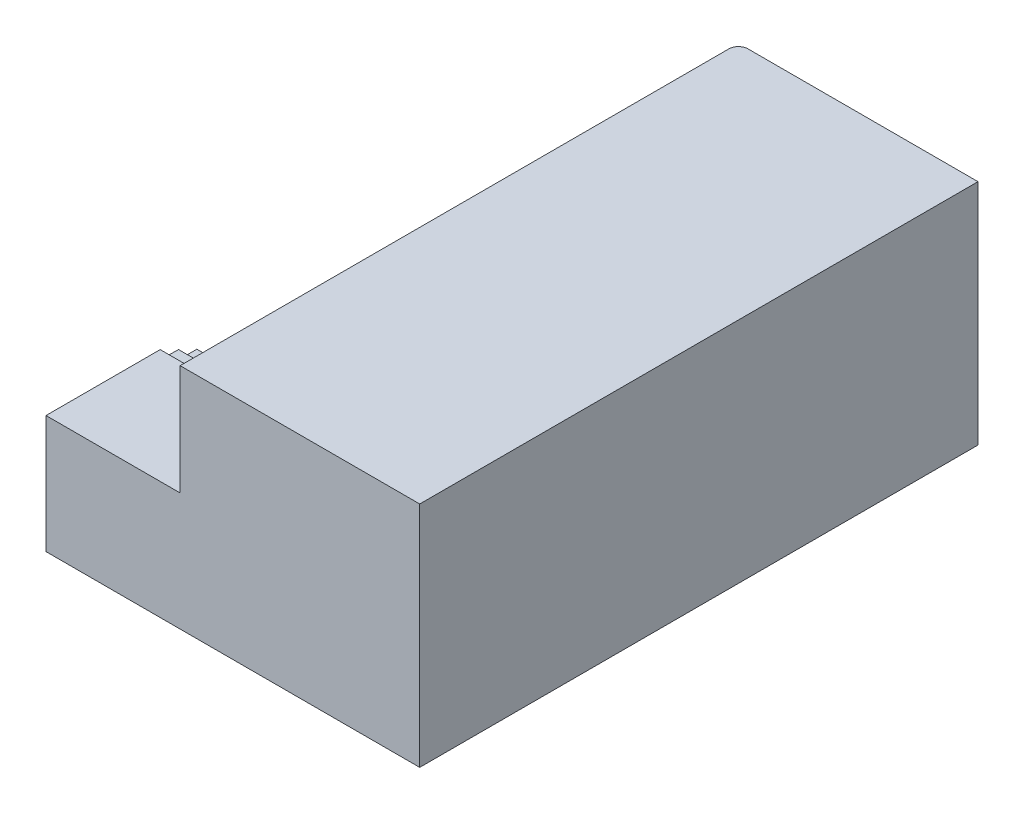
ISO-10303-21;
HEADER;
FILE_DESCRIPTION(('STEP AP214'),'2;1');
FILE_NAME('part.step','',(''),(''),'','','');
FILE_SCHEMA(('AUTOMOTIVE_DESIGN { 1 0 10303 214 1 1 1 1 }'));
ENDSEC;
DATA;
#1=APPLICATION_CONTEXT('core data for automotive mechanical design processes');
#2=APPLICATION_PROTOCOL_DEFINITION('international standard','automotive_design',2000,#1);
#3=PRODUCT_CONTEXT('',#1,'mechanical');
#4=PRODUCT('Part','Part','',(#3));
#5=PRODUCT_RELATED_PRODUCT_CATEGORY('part','',(#4));
#6=PRODUCT_DEFINITION_FORMATION('','',#4);
#7=PRODUCT_DEFINITION_CONTEXT('part definition',#1,'design');
#8=PRODUCT_DEFINITION('design','',#6,#7);
#9=PRODUCT_DEFINITION_SHAPE('','',#8);
#10=(LENGTH_UNIT() NAMED_UNIT(*) SI_UNIT(.MILLI.,.METRE.));
#11=(NAMED_UNIT(*) PLANE_ANGLE_UNIT() SI_UNIT($,.RADIAN.));
#12=(NAMED_UNIT(*) SI_UNIT($,.STERADIAN.) SOLID_ANGLE_UNIT());
#13=UNCERTAINTY_MEASURE_WITH_UNIT(LENGTH_MEASURE(1.E-05),#10,'distance_accuracy_value','');
#14=(GEOMETRIC_REPRESENTATION_CONTEXT(3) GLOBAL_UNCERTAINTY_ASSIGNED_CONTEXT((#13)) GLOBAL_UNIT_ASSIGNED_CONTEXT((#10,
#11,#12)) REPRESENTATION_CONTEXT('',''));
#15=CARTESIAN_POINT('',(0.,0.,0.));
#16=DIRECTION('',(0.,0.,1.));
#17=DIRECTION('',(1.,0.,0.));
#18=AXIS2_PLACEMENT_3D('',#15,#16,#17);
#19=CARTESIAN_POINT('',(-280.,73.7131457703675,60.));
#20=DIRECTION('',(0.,0.,-1.));
#21=DIRECTION('',(-1.,0.,0.));
#22=AXIS2_PLACEMENT_3D('',#19,#20,#21);
#23=PLANE('',#22);
#24=DIRECTION('',(0.,1.,0.));
#25=VECTOR('',#24,1.);
#26=CARTESIAN_POINT('',(0.,73.7131457703675,60.));
#27=LINE('',#26,#25);
#28=CARTESIAN_POINT('',(0.,55.2131457703675,60.));
#29=VERTEX_POINT('',#28);
#30=CARTESIAN_POINT('',(0.,73.7131457703675,60.));
#31=VERTEX_POINT('',#30);
#32=EDGE_CURVE('E328',#29,#31,#27,.T.);
#33=ORIENTED_EDGE('',*,*,#32,.F.);
#34=DIRECTION('',(1.,0.,0.));
#35=VECTOR('',#34,1.);
#36=CARTESIAN_POINT('',(-280.,55.2131457703675,60.));
#37=LINE('',#36,#35);
#38=CARTESIAN_POINT('',(-280.,55.2131457703675,60.));
#39=VERTEX_POINT('',#38);
#40=EDGE_CURVE('E535',#39,#29,#37,.T.);
#41=ORIENTED_EDGE('',*,*,#40,.F.);
#42=DIRECTION('',(0.,1.,0.));
#43=VECTOR('',#42,1.);
#44=CARTESIAN_POINT('',(-280.,73.7131457703675,60.));
#45=LINE('',#44,#43);
#46=CARTESIAN_POINT('',(-280.,73.7131457703675,60.));
#47=VERTEX_POINT('',#46);
#48=EDGE_CURVE('E329',#39,#47,#45,.T.);
#49=ORIENTED_EDGE('',*,*,#48,.T.);
#50=DIRECTION('',(1.,0.,0.));
#51=VECTOR('',#50,1.);
#52=CARTESIAN_POINT('',(-280.,73.7131457703675,60.));
#53=LINE('',#52,#51);
#54=EDGE_CURVE('E432',#47,#31,#53,.T.);
#55=ORIENTED_EDGE('',*,*,#54,.T.);
#56=EDGE_LOOP('',(#33,#41,#49,#55));
#57=FACE_BOUND('',#56,.T.);
#58=ADVANCED_FACE('F39',(#57),#23,.T.);
#59=CARTESIAN_POINT('',(-280.,55.2131457703675,60.));
#60=DIRECTION('',(0.,0.99989905724305,-0.0142082836563894));
#61=DIRECTION('',(0.,0.0142082836563894,0.99989905724305));
#62=AXIS2_PLACEMENT_3D('',#59,#60,#61);
#63=PLANE('',#62);
#64=DIRECTION('',(0.,0.0142082836563894,0.99989905724305));
#65=VECTOR('',#64,1.);
#66=CARTESIAN_POINT('',(0.,55.2131457703675,60.));
#67=LINE('',#66,#65);
#68=CARTESIAN_POINT('',(0.,54.6689685063278,21.7038661075912));
#69=VERTEX_POINT('',#68);
#70=EDGE_CURVE('E334',#69,#29,#67,.T.);
#71=ORIENTED_EDGE('',*,*,#70,.F.);
#72=DIRECTION('',(1.,0.,0.));
#73=VECTOR('',#72,1.);
#74=CARTESIAN_POINT('',(-280.,54.6689685063278,21.7038661075912));
#75=LINE('',#74,#73);
#76=CARTESIAN_POINT('',(-280.,54.6689685063278,21.7038661075912));
#77=VERTEX_POINT('',#76);
#78=EDGE_CURVE('E540',#77,#69,#75,.T.);
#79=ORIENTED_EDGE('',*,*,#78,.F.);
#80=DIRECTION('',(0.,0.0142082836563894,0.99989905724305));
#81=VECTOR('',#80,1.);
#82=CARTESIAN_POINT('',(-280.,55.2131457703675,60.));
#83=LINE('',#82,#81);
#84=EDGE_CURVE('E428',#77,#39,#83,.T.);
#85=ORIENTED_EDGE('',*,*,#84,.T.);
#86=ORIENTED_EDGE('',*,*,#40,.T.);
#87=EDGE_LOOP('',(#71,#79,#85,#86));
#88=FACE_BOUND('',#87,.T.);
#89=ADVANCED_FACE('F645',(#88),#63,.T.);
#90=CARTESIAN_POINT('',(-280.,54.6689685063278,21.7038661075912));
#91=DIRECTION('',(0.,0.,-1.));
#92=DIRECTION('',(0.,1.,0.));
#93=AXIS2_PLACEMENT_3D('',#90,#91,#92);
#94=PLANE('',#93);
#95=DIRECTION('',(0.,1.,0.));
#96=VECTOR('',#95,1.);
#97=CARTESIAN_POINT('',(0.,54.6689685063278,21.7038661075912));
#98=LINE('',#97,#96);
#99=CARTESIAN_POINT('',(0.,36.1689685063278,21.7038661075912));
#100=VERTEX_POINT('',#99);
#101=EDGE_CURVE('E528',#100,#69,#98,.T.);
#102=ORIENTED_EDGE('',*,*,#101,.F.);
#103=DIRECTION('',(1.,0.,0.));
#104=VECTOR('',#103,1.);
#105=CARTESIAN_POINT('',(-280.,36.1689685063278,21.7038661075912));
#106=LINE('',#105,#104);
#107=CARTESIAN_POINT('',(-280.,36.1689685063278,21.7038661075912));
#108=VERTEX_POINT('',#107);
#109=EDGE_CURVE('E543',#108,#100,#106,.T.);
#110=ORIENTED_EDGE('',*,*,#109,.F.);
#111=DIRECTION('',(0.,1.,0.));
#112=VECTOR('',#111,1.);
#113=CARTESIAN_POINT('',(-280.,54.6689685063278,21.7038661075912));
#114=LINE('',#113,#112);
#115=EDGE_CURVE('E424',#108,#77,#114,.T.);
#116=ORIENTED_EDGE('',*,*,#115,.T.);
#117=ORIENTED_EDGE('',*,*,#78,.T.);
#118=EDGE_LOOP('',(#102,#110,#116,#117));
#119=FACE_BOUND('',#118,.T.);
#120=ADVANCED_FACE('F650',(#119),#94,.T.);
#121=CARTESIAN_POINT('',(-280.,36.1689685063278,21.7038661075912));
#122=DIRECTION('',(0.,1.,0.));
#123=DIRECTION('',(0.,0.,1.));
#124=AXIS2_PLACEMENT_3D('',#121,#122,#123);
#125=PLANE('',#124);
#126=DIRECTION('',(0.,0.,1.));
#127=VECTOR('',#126,1.);
#128=CARTESIAN_POINT('',(0.,36.1689685063278,21.7038661075912));
#129=LINE('',#128,#127);
#130=CARTESIAN_POINT('',(0.,36.1689685063278,-16.5961338924088));
#131=VERTEX_POINT('',#130);
#132=EDGE_CURVE('E524',#131,#100,#129,.T.);
#133=ORIENTED_EDGE('',*,*,#132,.F.);
#134=DIRECTION('',(1.,0.,0.));
#135=VECTOR('',#134,1.);
#136=CARTESIAN_POINT('',(-280.,36.1689685063278,-16.5961338924088));
#137=LINE('',#136,#135);
#138=CARTESIAN_POINT('',(-280.,36.1689685063278,-16.5961338924088));
#139=VERTEX_POINT('',#138);
#140=EDGE_CURVE('E546',#139,#131,#137,.T.);
#141=ORIENTED_EDGE('',*,*,#140,.F.);
#142=DIRECTION('',(0.,0.,1.));
#143=VECTOR('',#142,1.);
#144=CARTESIAN_POINT('',(-280.,36.1689685063278,21.7038661075912));
#145=LINE('',#144,#143);
#146=EDGE_CURVE('E420',#139,#108,#145,.T.);
#147=ORIENTED_EDGE('',*,*,#146,.T.);
#148=ORIENTED_EDGE('',*,*,#109,.T.);
#149=EDGE_LOOP('',(#133,#141,#147,#148));
#150=FACE_BOUND('',#149,.T.);
#151=ADVANCED_FACE('F739',(#150),#125,.T.);
#152=CARTESIAN_POINT('',(-280.,36.1689685063278,-16.5961338924088));
#153=DIRECTION('',(0.,0.,-1.));
#154=DIRECTION('',(0.,1.,0.));
#155=AXIS2_PLACEMENT_3D('',#152,#153,#154);
#156=PLANE('',#155);
#157=DIRECTION('',(0.,1.,0.));
#158=VECTOR('',#157,1.);
#159=CARTESIAN_POINT('',(0.,36.1689685063278,-16.5961338924088));
#160=LINE('',#159,#158);
#161=CARTESIAN_POINT('',(0.,17.6689685063278,-16.5961338924088));
#162=VERTEX_POINT('',#161);
#163=EDGE_CURVE('E520',#162,#131,#160,.T.);
#164=ORIENTED_EDGE('',*,*,#163,.F.);
#165=DIRECTION('',(1.,0.,0.));
#166=VECTOR('',#165,1.);
#167=CARTESIAN_POINT('',(-280.,17.6689685063278,-16.5961338924088));
#168=LINE('',#167,#166);
#169=CARTESIAN_POINT('',(-280.,17.6689685063278,-16.5961338924088));
#170=VERTEX_POINT('',#169);
#171=EDGE_CURVE('E549',#170,#162,#168,.T.);
#172=ORIENTED_EDGE('',*,*,#171,.F.);
#173=DIRECTION('',(0.,1.,0.));
#174=VECTOR('',#173,1.);
#175=CARTESIAN_POINT('',(-280.,36.1689685063278,-16.5961338924088));
#176=LINE('',#175,#174);
#177=EDGE_CURVE('E416',#170,#139,#176,.T.);
#178=ORIENTED_EDGE('',*,*,#177,.T.);
#179=ORIENTED_EDGE('',*,*,#140,.T.);
#180=EDGE_LOOP('',(#164,#172,#178,#179));
#181=FACE_BOUND('',#180,.T.);
#182=ADVANCED_FACE('F735',(#181),#156,.T.);
#183=CARTESIAN_POINT('',(-280.,17.6689685063278,-16.5961338924088));
#184=DIRECTION('',(0.,1.,0.));
#185=DIRECTION('',(0.,0.,1.));
#186=AXIS2_PLACEMENT_3D('',#183,#184,#185);
#187=PLANE('',#186);
#188=DIRECTION('',(0.,0.,1.));
#189=VECTOR('',#188,1.);
#190=CARTESIAN_POINT('',(0.,17.6689685063278,-16.5961338924088));
#191=LINE('',#190,#189);
#192=CARTESIAN_POINT('',(0.,17.6689685063278,-54.8961338924088));
#193=VERTEX_POINT('',#192);
#194=EDGE_CURVE('E516',#193,#162,#191,.T.);
#195=ORIENTED_EDGE('',*,*,#194,.F.);
#196=DIRECTION('',(1.,0.,0.));
#197=VECTOR('',#196,1.);
#198=CARTESIAN_POINT('',(-280.,17.6689685063278,-54.8961338924088));
#199=LINE('',#198,#197);
#200=CARTESIAN_POINT('',(-280.,17.6689685063278,-54.8961338924088));
#201=VERTEX_POINT('',#200);
#202=EDGE_CURVE('E552',#201,#193,#199,.T.);
#203=ORIENTED_EDGE('',*,*,#202,.F.);
#204=DIRECTION('',(0.,0.,1.));
#205=VECTOR('',#204,1.);
#206=CARTESIAN_POINT('',(-280.,17.6689685063278,-16.5961338924088));
#207=LINE('',#206,#205);
#208=EDGE_CURVE('E412',#201,#170,#207,.T.);
#209=ORIENTED_EDGE('',*,*,#208,.T.);
#210=ORIENTED_EDGE('',*,*,#171,.T.);
#211=EDGE_LOOP('',(#195,#203,#209,#210));
#212=FACE_BOUND('',#211,.T.);
#213=ADVANCED_FACE('F731',(#212),#187,.T.);
#214=CARTESIAN_POINT('',(-280.,17.6689685063278,-54.8961338924088));
#215=DIRECTION('',(0.,0.,-1.));
#216=DIRECTION('',(-1.,0.,0.));
#217=AXIS2_PLACEMENT_3D('',#214,#215,#216);
#218=PLANE('',#217);
#219=DIRECTION('',(0.,1.,0.));
#220=VECTOR('',#219,1.);
#221=CARTESIAN_POINT('',(0.,17.6689685063278,-54.8961338924088));
#222=LINE('',#221,#220);
#223=CARTESIAN_POINT('',(0.,-0.831031493672165,-54.8961338924088));
#224=VERTEX_POINT('',#223);
#225=EDGE_CURVE('E512',#224,#193,#222,.T.);
#226=ORIENTED_EDGE('',*,*,#225,.F.);
#227=DIRECTION('',(1.,0.,0.));
#228=VECTOR('',#227,1.);
#229=CARTESIAN_POINT('',(-280.,-0.831031493672165,-54.8961338924088));
#230=LINE('',#229,#228);
#231=CARTESIAN_POINT('',(-280.,-0.831031493672165,-54.8961338924088));
#232=VERTEX_POINT('',#231);
#233=EDGE_CURVE('E555',#232,#224,#230,.T.);
#234=ORIENTED_EDGE('',*,*,#233,.F.);
#235=DIRECTION('',(0.,1.,0.));
#236=VECTOR('',#235,1.);
#237=CARTESIAN_POINT('',(-280.,17.6689685063278,-54.8961338924088));
#238=LINE('',#237,#236);
#239=EDGE_CURVE('E408',#232,#201,#238,.T.);
#240=ORIENTED_EDGE('',*,*,#239,.T.);
#241=ORIENTED_EDGE('',*,*,#202,.T.);
#242=EDGE_LOOP('',(#226,#234,#240,#241));
#243=FACE_BOUND('',#242,.T.);
#244=ADVANCED_FACE('F727',(#243),#218,.T.);
#245=CARTESIAN_POINT('',(-280.,-0.831031493672165,-54.8961338924088));
#246=DIRECTION('',(0.,1.,0.));
#247=DIRECTION('',(0.,0.,1.));
#248=AXIS2_PLACEMENT_3D('',#245,#246,#247);
#249=PLANE('',#248);
#250=DIRECTION('',(0.,0.,1.));
#251=VECTOR('',#250,1.);
#252=CARTESIAN_POINT('',(0.,-0.831031493672165,-54.8961338924088));
#253=LINE('',#252,#251);
#254=CARTESIAN_POINT('',(0.,-0.831031493672158,-93.1961338924088));
#255=VERTEX_POINT('',#254);
#256=EDGE_CURVE('E508',#255,#224,#253,.T.);
#257=ORIENTED_EDGE('',*,*,#256,.F.);
#258=DIRECTION('',(1.,0.,0.));
#259=VECTOR('',#258,1.);
#260=CARTESIAN_POINT('',(-280.,-0.831031493672158,-93.1961338924088));
#261=LINE('',#260,#259);
#262=CARTESIAN_POINT('',(-280.,-0.831031493672158,-93.1961338924088));
#263=VERTEX_POINT('',#262);
#264=EDGE_CURVE('E558',#263,#255,#261,.T.);
#265=ORIENTED_EDGE('',*,*,#264,.F.);
#266=DIRECTION('',(0.,0.,1.));
#267=VECTOR('',#266,1.);
#268=CARTESIAN_POINT('',(-280.,-0.831031493672165,-54.8961338924088));
#269=LINE('',#268,#267);
#270=EDGE_CURVE('E404',#263,#232,#269,.T.);
#271=ORIENTED_EDGE('',*,*,#270,.T.);
#272=ORIENTED_EDGE('',*,*,#233,.T.);
#273=EDGE_LOOP('',(#257,#265,#271,#272));
#274=FACE_BOUND('',#273,.T.);
#275=ADVANCED_FACE('F723',(#274),#249,.T.);
#276=CARTESIAN_POINT('',(-280.,-0.831031493672158,-93.1961338924088));
#277=DIRECTION('',(0.,0.,-1.));
#278=DIRECTION('',(-1.,0.,0.));
#279=AXIS2_PLACEMENT_3D('',#276,#277,#278);
#280=PLANE('',#279);
#281=DIRECTION('',(0.,1.,0.));
#282=VECTOR('',#281,1.);
#283=CARTESIAN_POINT('',(0.,-0.831031493672158,-93.1961338924088));
#284=LINE('',#283,#282);
#285=CARTESIAN_POINT('',(0.,-19.3310314936722,-93.1961338924088));
#286=VERTEX_POINT('',#285);
#287=EDGE_CURVE('E504',#286,#255,#284,.T.);
#288=ORIENTED_EDGE('',*,*,#287,.F.);
#289=DIRECTION('',(1.,0.,0.));
#290=VECTOR('',#289,1.);
#291=CARTESIAN_POINT('',(-280.,-19.3310314936722,-93.1961338924088));
#292=LINE('',#291,#290);
#293=CARTESIAN_POINT('',(-280.,-19.3310314936722,-93.1961338924088));
#294=VERTEX_POINT('',#293);
#295=EDGE_CURVE('E561',#294,#286,#292,.T.);
#296=ORIENTED_EDGE('',*,*,#295,.F.);
#297=DIRECTION('',(0.,1.,0.));
#298=VECTOR('',#297,1.);
#299=CARTESIAN_POINT('',(-280.,-0.831031493672158,-93.1961338924088));
#300=LINE('',#299,#298);
#301=EDGE_CURVE('E400',#294,#263,#300,.T.);
#302=ORIENTED_EDGE('',*,*,#301,.T.);
#303=ORIENTED_EDGE('',*,*,#264,.T.);
#304=EDGE_LOOP('',(#288,#296,#302,#303));
#305=FACE_BOUND('',#304,.T.);
#306=ADVANCED_FACE('F719',(#305),#280,.T.);
#307=CARTESIAN_POINT('',(-280.,-19.3310314936722,-93.1961338924088));
#308=DIRECTION('',(0.,1.,0.));
#309=DIRECTION('',(0.,0.,1.));
#310=AXIS2_PLACEMENT_3D('',#307,#308,#309);
#311=PLANE('',#310);
#312=DIRECTION('',(0.,0.,1.));
#313=VECTOR('',#312,1.);
#314=CARTESIAN_POINT('',(0.,-19.3310314936722,-93.1961338924088));
#315=LINE('',#314,#313);
#316=CARTESIAN_POINT('',(0.,-19.3310314936721,-131.496133892409));
#317=VERTEX_POINT('',#316);
#318=EDGE_CURVE('E500',#317,#286,#315,.T.);
#319=ORIENTED_EDGE('',*,*,#318,.F.);
#320=DIRECTION('',(1.,0.,0.));
#321=VECTOR('',#320,1.);
#322=CARTESIAN_POINT('',(-280.,-19.3310314936721,-131.496133892409));
#323=LINE('',#322,#321);
#324=CARTESIAN_POINT('',(-280.,-19.3310314936721,-131.496133892409));
#325=VERTEX_POINT('',#324);
#326=EDGE_CURVE('E564',#325,#317,#323,.T.);
#327=ORIENTED_EDGE('',*,*,#326,.F.);
#328=DIRECTION('',(0.,0.,1.));
#329=VECTOR('',#328,1.);
#330=CARTESIAN_POINT('',(-280.,-19.3310314936722,-93.1961338924088));
#331=LINE('',#330,#329);
#332=EDGE_CURVE('E396',#325,#294,#331,.T.);
#333=ORIENTED_EDGE('',*,*,#332,.T.);
#334=ORIENTED_EDGE('',*,*,#295,.T.);
#335=EDGE_LOOP('',(#319,#327,#333,#334));
#336=FACE_BOUND('',#335,.T.);
#337=ADVANCED_FACE('F715',(#336),#311,.T.);
#338=CARTESIAN_POINT('',(-280.,-19.3310314936721,-131.496133892409));
#339=DIRECTION('',(0.,0.,-1.));
#340=DIRECTION('',(-1.,0.,0.));
#341=AXIS2_PLACEMENT_3D('',#338,#339,#340);
#342=PLANE('',#341);
#343=DIRECTION('',(0.,1.,0.));
#344=VECTOR('',#343,1.);
#345=CARTESIAN_POINT('',(0.,-19.3310314936721,-131.496133892409));
#346=LINE('',#345,#344);
#347=CARTESIAN_POINT('',(0.,-37.8310314936721,-131.496133892409));
#348=VERTEX_POINT('',#347);
#349=EDGE_CURVE('E496',#348,#317,#346,.T.);
#350=ORIENTED_EDGE('',*,*,#349,.F.);
#351=DIRECTION('',(1.,0.,0.));
#352=VECTOR('',#351,1.);
#353=CARTESIAN_POINT('',(-280.,-37.8310314936721,-131.496133892409));
#354=LINE('',#353,#352);
#355=CARTESIAN_POINT('',(-280.,-37.8310314936721,-131.496133892409));
#356=VERTEX_POINT('',#355);
#357=EDGE_CURVE('E567',#356,#348,#354,.T.);
#358=ORIENTED_EDGE('',*,*,#357,.F.);
#359=DIRECTION('',(0.,1.,0.));
#360=VECTOR('',#359,1.);
#361=CARTESIAN_POINT('',(-280.,-19.3310314936721,-131.496133892409));
#362=LINE('',#361,#360);
#363=EDGE_CURVE('E392',#356,#325,#362,.T.);
#364=ORIENTED_EDGE('',*,*,#363,.T.);
#365=ORIENTED_EDGE('',*,*,#326,.T.);
#366=EDGE_LOOP('',(#350,#358,#364,#365));
#367=FACE_BOUND('',#366,.T.);
#368=ADVANCED_FACE('F711',(#367),#342,.T.);
#369=CARTESIAN_POINT('',(-280.,-37.8310314936721,-131.496133892409));
#370=DIRECTION('',(0.,1.,0.));
#371=DIRECTION('',(0.,0.,1.));
#372=AXIS2_PLACEMENT_3D('',#369,#370,#371);
#373=PLANE('',#372);
#374=DIRECTION('',(0.,0.,1.));
#375=VECTOR('',#374,1.);
#376=CARTESIAN_POINT('',(0.,-37.8310314936721,-131.496133892409));
#377=LINE('',#376,#375);
#378=CARTESIAN_POINT('',(0.,-37.8310314936721,-169.796133892409));
#379=VERTEX_POINT('',#378);
#380=EDGE_CURVE('E492',#379,#348,#377,.T.);
#381=ORIENTED_EDGE('',*,*,#380,.F.);
#382=DIRECTION('',(1.,0.,0.));
#383=VECTOR('',#382,1.);
#384=CARTESIAN_POINT('',(-280.,-37.8310314936721,-169.796133892409));
#385=LINE('',#384,#383);
#386=CARTESIAN_POINT('',(-280.,-37.8310314936721,-169.796133892409));
#387=VERTEX_POINT('',#386);
#388=EDGE_CURVE('E570',#387,#379,#385,.T.);
#389=ORIENTED_EDGE('',*,*,#388,.F.);
#390=DIRECTION('',(0.,0.,1.));
#391=VECTOR('',#390,1.);
#392=CARTESIAN_POINT('',(-280.,-37.8310314936721,-131.496133892409));
#393=LINE('',#392,#391);
#394=EDGE_CURVE('E388',#387,#356,#393,.T.);
#395=ORIENTED_EDGE('',*,*,#394,.T.);
#396=ORIENTED_EDGE('',*,*,#357,.T.);
#397=EDGE_LOOP('',(#381,#389,#395,#396));
#398=FACE_BOUND('',#397,.T.);
#399=ADVANCED_FACE('F707',(#398),#373,.T.);
#400=CARTESIAN_POINT('',(-280.,-37.8310314936721,-169.796133892409));
#401=DIRECTION('',(0.,0.,-1.));
#402=DIRECTION('',(-1.,0.,0.));
#403=AXIS2_PLACEMENT_3D('',#400,#401,#402);
#404=PLANE('',#403);
#405=DIRECTION('',(0.,1.,0.));
#406=VECTOR('',#405,1.);
#407=CARTESIAN_POINT('',(0.,-37.8310314936721,-169.796133892409));
#408=LINE('',#407,#406);
#409=CARTESIAN_POINT('',(0.,-56.3310314936721,-169.796133892409));
#410=VERTEX_POINT('',#409);
#411=EDGE_CURVE('E488',#410,#379,#408,.T.);
#412=ORIENTED_EDGE('',*,*,#411,.F.);
#413=DIRECTION('',(1.,0.,0.));
#414=VECTOR('',#413,1.);
#415=CARTESIAN_POINT('',(-280.,-56.3310314936721,-169.796133892409));
#416=LINE('',#415,#414);
#417=CARTESIAN_POINT('',(-280.,-56.3310314936721,-169.796133892409));
#418=VERTEX_POINT('',#417);
#419=EDGE_CURVE('E573',#418,#410,#416,.T.);
#420=ORIENTED_EDGE('',*,*,#419,.F.);
#421=DIRECTION('',(0.,1.,0.));
#422=VECTOR('',#421,1.);
#423=CARTESIAN_POINT('',(-280.,-37.8310314936721,-169.796133892409));
#424=LINE('',#423,#422);
#425=EDGE_CURVE('E384',#418,#387,#424,.T.);
#426=ORIENTED_EDGE('',*,*,#425,.T.);
#427=ORIENTED_EDGE('',*,*,#388,.T.);
#428=EDGE_LOOP('',(#412,#420,#426,#427));
#429=FACE_BOUND('',#428,.T.);
#430=ADVANCED_FACE('F703',(#429),#404,.T.);
#431=CARTESIAN_POINT('',(-280.,-56.3310314936721,-169.796133892409));
#432=DIRECTION('',(0.,1.,0.));
#433=DIRECTION('',(0.,0.,1.));
#434=AXIS2_PLACEMENT_3D('',#431,#432,#433);
#435=PLANE('',#434);
#436=DIRECTION('',(0.,0.,1.));
#437=VECTOR('',#436,1.);
#438=CARTESIAN_POINT('',(0.,-56.3310314936721,-169.796133892409));
#439=LINE('',#438,#437);
#440=CARTESIAN_POINT('',(0.,-56.3310314936721,-208.096133892409));
#441=VERTEX_POINT('',#440);
#442=EDGE_CURVE('E484',#441,#410,#439,.T.);
#443=ORIENTED_EDGE('',*,*,#442,.F.);
#444=DIRECTION('',(1.,0.,0.));
#445=VECTOR('',#444,1.);
#446=CARTESIAN_POINT('',(-280.,-56.3310314936721,-208.096133892409));
#447=LINE('',#446,#445);
#448=CARTESIAN_POINT('',(-280.,-56.3310314936721,-208.096133892409));
#449=VERTEX_POINT('',#448);
#450=EDGE_CURVE('E576',#449,#441,#447,.T.);
#451=ORIENTED_EDGE('',*,*,#450,.F.);
#452=DIRECTION('',(0.,0.,1.));
#453=VECTOR('',#452,1.);
#454=CARTESIAN_POINT('',(-280.,-56.3310314936721,-169.796133892409));
#455=LINE('',#454,#453);
#456=EDGE_CURVE('E380',#449,#418,#455,.T.);
#457=ORIENTED_EDGE('',*,*,#456,.T.);
#458=ORIENTED_EDGE('',*,*,#419,.T.);
#459=EDGE_LOOP('',(#443,#451,#457,#458));
#460=FACE_BOUND('',#459,.T.);
#461=ADVANCED_FACE('F699',(#460),#435,.T.);
#462=CARTESIAN_POINT('',(-280.,-56.3310314936721,-208.096133892409));
#463=DIRECTION('',(0.,0.,-1.));
#464=DIRECTION('',(0.,1.,0.));
#465=AXIS2_PLACEMENT_3D('',#462,#463,#464);
#466=PLANE('',#465);
#467=DIRECTION('',(0.,1.,0.));
#468=VECTOR('',#467,1.);
#469=CARTESIAN_POINT('',(0.,-56.3310314936721,-208.096133892409));
#470=LINE('',#469,#468);
#471=CARTESIAN_POINT('',(0.,-74.8310314936721,-208.096133892409));
#472=VERTEX_POINT('',#471);
#473=EDGE_CURVE('E480',#472,#441,#470,.T.);
#474=ORIENTED_EDGE('',*,*,#473,.F.);
#475=DIRECTION('',(1.,0.,0.));
#476=VECTOR('',#475,1.);
#477=CARTESIAN_POINT('',(-280.,-74.8310314936721,-208.096133892409));
#478=LINE('',#477,#476);
#479=CARTESIAN_POINT('',(-280.,-74.8310314936721,-208.096133892409));
#480=VERTEX_POINT('',#479);
#481=EDGE_CURVE('E579',#480,#472,#478,.T.);
#482=ORIENTED_EDGE('',*,*,#481,.F.);
#483=DIRECTION('',(0.,1.,0.));
#484=VECTOR('',#483,1.);
#485=CARTESIAN_POINT('',(-280.,-56.3310314936721,-208.096133892409));
#486=LINE('',#485,#484);
#487=EDGE_CURVE('E376',#480,#449,#486,.T.);
#488=ORIENTED_EDGE('',*,*,#487,.T.);
#489=ORIENTED_EDGE('',*,*,#450,.T.);
#490=EDGE_LOOP('',(#474,#482,#488,#489));
#491=FACE_BOUND('',#490,.T.);
#492=ADVANCED_FACE('F695',(#491),#466,.T.);
#493=CARTESIAN_POINT('',(-280.,-74.8310314936721,-208.096133892409));
#494=DIRECTION('',(0.,1.,0.));
#495=DIRECTION('',(0.,0.,1.));
#496=AXIS2_PLACEMENT_3D('',#493,#494,#495);
#497=PLANE('',#496);
#498=DIRECTION('',(0.,0.,1.));
#499=VECTOR('',#498,1.);
#500=CARTESIAN_POINT('',(0.,-74.8310314936721,-208.096133892409));
#501=LINE('',#500,#499);
#502=CARTESIAN_POINT('',(0.,-74.8310314936721,-246.396133892409));
#503=VERTEX_POINT('',#502);
#504=EDGE_CURVE('E476',#503,#472,#501,.T.);
#505=ORIENTED_EDGE('',*,*,#504,.F.);
#506=DIRECTION('',(1.,0.,0.));
#507=VECTOR('',#506,1.);
#508=CARTESIAN_POINT('',(-280.,-74.8310314936721,-246.396133892409));
#509=LINE('',#508,#507);
#510=CARTESIAN_POINT('',(-280.,-74.8310314936721,-246.396133892409));
#511=VERTEX_POINT('',#510);
#512=EDGE_CURVE('E582',#511,#503,#509,.T.);
#513=ORIENTED_EDGE('',*,*,#512,.F.);
#514=DIRECTION('',(0.,0.,1.));
#515=VECTOR('',#514,1.);
#516=CARTESIAN_POINT('',(-280.,-74.8310314936721,-208.096133892409));
#517=LINE('',#516,#515);
#518=EDGE_CURVE('E372',#511,#480,#517,.T.);
#519=ORIENTED_EDGE('',*,*,#518,.T.);
#520=ORIENTED_EDGE('',*,*,#481,.T.);
#521=EDGE_LOOP('',(#505,#513,#519,#520));
#522=FACE_BOUND('',#521,.T.);
#523=ADVANCED_FACE('F691',(#522),#497,.T.);
#524=CARTESIAN_POINT('',(-280.,-74.8310314936721,-246.396133892409));
#525=DIRECTION('',(0.,0.,-1.));
#526=DIRECTION('',(-1.,0.,0.));
#527=AXIS2_PLACEMENT_3D('',#524,#525,#526);
#528=PLANE('',#527);
#529=DIRECTION('',(0.,1.,0.));
#530=VECTOR('',#529,1.);
#531=CARTESIAN_POINT('',(0.,-74.8310314936721,-246.396133892409));
#532=LINE('',#531,#530);
#533=CARTESIAN_POINT('',(0.,-93.3310314936721,-246.396133892409));
#534=VERTEX_POINT('',#533);
#535=EDGE_CURVE('E472',#534,#503,#532,.T.);
#536=ORIENTED_EDGE('',*,*,#535,.F.);
#537=DIRECTION('',(1.,0.,0.));
#538=VECTOR('',#537,1.);
#539=CARTESIAN_POINT('',(-280.,-93.3310314936721,-246.396133892409));
#540=LINE('',#539,#538);
#541=CARTESIAN_POINT('',(-280.,-93.3310314936721,-246.396133892409));
#542=VERTEX_POINT('',#541);
#543=EDGE_CURVE('E585',#542,#534,#540,.T.);
#544=ORIENTED_EDGE('',*,*,#543,.F.);
#545=DIRECTION('',(0.,1.,0.));
#546=VECTOR('',#545,1.);
#547=CARTESIAN_POINT('',(-280.,-74.8310314936721,-246.396133892409));
#548=LINE('',#547,#546);
#549=EDGE_CURVE('E368',#542,#511,#548,.T.);
#550=ORIENTED_EDGE('',*,*,#549,.T.);
#551=ORIENTED_EDGE('',*,*,#512,.T.);
#552=EDGE_LOOP('',(#536,#544,#550,#551));
#553=FACE_BOUND('',#552,.T.);
#554=ADVANCED_FACE('F687',(#553),#528,.T.);
#555=CARTESIAN_POINT('',(-280.,-93.3310314936721,-246.396133892409));
#556=DIRECTION('',(0.,1.,0.));
#557=DIRECTION('',(0.,0.,1.));
#558=AXIS2_PLACEMENT_3D('',#555,#556,#557);
#559=PLANE('',#558);
#560=DIRECTION('',(0.,0.,1.));
#561=VECTOR('',#560,1.);
#562=CARTESIAN_POINT('',(0.,-93.3310314936721,-246.396133892409));
#563=LINE('',#562,#561);
#564=CARTESIAN_POINT('',(0.,-93.3310314936721,-284.696133892409));
#565=VERTEX_POINT('',#564);
#566=EDGE_CURVE('E468',#565,#534,#563,.T.);
#567=ORIENTED_EDGE('',*,*,#566,.F.);
#568=DIRECTION('',(1.,0.,0.));
#569=VECTOR('',#568,1.);
#570=CARTESIAN_POINT('',(-280.,-93.3310314936721,-284.696133892409));
#571=LINE('',#570,#569);
#572=CARTESIAN_POINT('',(-280.,-93.3310314936721,-284.696133892409));
#573=VERTEX_POINT('',#572);
#574=EDGE_CURVE('E588',#573,#565,#571,.T.);
#575=ORIENTED_EDGE('',*,*,#574,.F.);
#576=DIRECTION('',(0.,0.,1.));
#577=VECTOR('',#576,1.);
#578=CARTESIAN_POINT('',(-280.,-93.3310314936721,-246.396133892409));
#579=LINE('',#578,#577);
#580=EDGE_CURVE('E364',#573,#542,#579,.T.);
#581=ORIENTED_EDGE('',*,*,#580,.T.);
#582=ORIENTED_EDGE('',*,*,#543,.T.);
#583=EDGE_LOOP('',(#567,#575,#581,#582));
#584=FACE_BOUND('',#583,.T.);
#585=ADVANCED_FACE('F683',(#584),#559,.T.);
#586=CARTESIAN_POINT('',(-280.,-93.3310314936721,-284.696133892409));
#587=DIRECTION('',(0.,0.,-1.));
#588=DIRECTION('',(0.,1.,0.));
#589=AXIS2_PLACEMENT_3D('',#586,#587,#588);
#590=PLANE('',#589);
#591=DIRECTION('',(0.,1.,0.));
#592=VECTOR('',#591,1.);
#593=CARTESIAN_POINT('',(0.,-93.3310314936721,-284.696133892409));
#594=LINE('',#593,#592);
#595=CARTESIAN_POINT('',(0.,-111.831031493672,-284.696133892409));
#596=VERTEX_POINT('',#595);
#597=EDGE_CURVE('E464',#596,#565,#594,.T.);
#598=ORIENTED_EDGE('',*,*,#597,.F.);
#599=DIRECTION('',(1.,0.,0.));
#600=VECTOR('',#599,1.);
#601=CARTESIAN_POINT('',(-280.,-111.831031493672,-284.696133892409));
#602=LINE('',#601,#600);
#603=CARTESIAN_POINT('',(-280.,-111.831031493672,-284.696133892409));
#604=VERTEX_POINT('',#603);
#605=EDGE_CURVE('E591',#604,#596,#602,.T.);
#606=ORIENTED_EDGE('',*,*,#605,.F.);
#607=DIRECTION('',(0.,1.,0.));
#608=VECTOR('',#607,1.);
#609=CARTESIAN_POINT('',(-280.,-93.3310314936721,-284.696133892409));
#610=LINE('',#609,#608);
#611=EDGE_CURVE('E360',#604,#573,#610,.T.);
#612=ORIENTED_EDGE('',*,*,#611,.T.);
#613=ORIENTED_EDGE('',*,*,#574,.T.);
#614=EDGE_LOOP('',(#598,#606,#612,#613));
#615=FACE_BOUND('',#614,.T.);
#616=ADVANCED_FACE('F679',(#615),#590,.T.);
#617=CARTESIAN_POINT('',(-280.,-111.831031493672,-284.696133892409));
#618=DIRECTION('',(0.,1.,0.));
#619=DIRECTION('',(0.,0.,1.));
#620=AXIS2_PLACEMENT_3D('',#617,#618,#619);
#621=PLANE('',#620);
#622=DIRECTION('',(0.,0.,1.));
#623=VECTOR('',#622,1.);
#624=CARTESIAN_POINT('',(0.,-111.831031493672,-284.696133892409));
#625=LINE('',#624,#623);
#626=CARTESIAN_POINT('',(0.,-111.831031493672,-322.996133892409));
#627=VERTEX_POINT('',#626);
#628=EDGE_CURVE('E460',#627,#596,#625,.T.);
#629=ORIENTED_EDGE('',*,*,#628,.F.);
#630=DIRECTION('',(1.,0.,0.));
#631=VECTOR('',#630,1.);
#632=CARTESIAN_POINT('',(-280.,-111.831031493672,-322.996133892409));
#633=LINE('',#632,#631);
#634=CARTESIAN_POINT('',(-280.,-111.831031493672,-322.996133892409));
#635=VERTEX_POINT('',#634);
#636=EDGE_CURVE('E594',#635,#627,#633,.T.);
#637=ORIENTED_EDGE('',*,*,#636,.F.);
#638=DIRECTION('',(0.,0.,1.));
#639=VECTOR('',#638,1.);
#640=CARTESIAN_POINT('',(-280.,-111.831031493672,-284.696133892409));
#641=LINE('',#640,#639);
#642=EDGE_CURVE('E356',#635,#604,#641,.T.);
#643=ORIENTED_EDGE('',*,*,#642,.T.);
#644=ORIENTED_EDGE('',*,*,#605,.T.);
#645=EDGE_LOOP('',(#629,#637,#643,#644));
#646=FACE_BOUND('',#645,.T.);
#647=ADVANCED_FACE('F675',(#646),#621,.T.);
#648=CARTESIAN_POINT('',(-280.,-111.831031493672,-322.996133892409));
#649=DIRECTION('',(0.,0.,-1.));
#650=DIRECTION('',(-1.,0.,0.));
#651=AXIS2_PLACEMENT_3D('',#648,#649,#650);
#652=PLANE('',#651);
#653=DIRECTION('',(0.,1.,0.));
#654=VECTOR('',#653,1.);
#655=CARTESIAN_POINT('',(0.,-111.831031493672,-322.996133892409));
#656=LINE('',#655,#654);
#657=CARTESIAN_POINT('',(0.,-130.331031493672,-322.996133892409));
#658=VERTEX_POINT('',#657);
#659=EDGE_CURVE('E456',#658,#627,#656,.T.);
#660=ORIENTED_EDGE('',*,*,#659,.F.);
#661=DIRECTION('',(1.,0.,0.));
#662=VECTOR('',#661,1.);
#663=CARTESIAN_POINT('',(-280.,-130.331031493672,-322.996133892409));
#664=LINE('',#663,#662);
#665=CARTESIAN_POINT('',(-280.,-130.331031493672,-322.996133892409));
#666=VERTEX_POINT('',#665);
#667=EDGE_CURVE('E597',#666,#658,#664,.T.);
#668=ORIENTED_EDGE('',*,*,#667,.F.);
#669=DIRECTION('',(0.,1.,0.));
#670=VECTOR('',#669,1.);
#671=CARTESIAN_POINT('',(-280.,-111.831031493672,-322.996133892409));
#672=LINE('',#671,#670);
#673=EDGE_CURVE('E352',#666,#635,#672,.T.);
#674=ORIENTED_EDGE('',*,*,#673,.T.);
#675=ORIENTED_EDGE('',*,*,#636,.T.);
#676=EDGE_LOOP('',(#660,#668,#674,#675));
#677=FACE_BOUND('',#676,.T.);
#678=ADVANCED_FACE('F671',(#677),#652,.T.);
#679=CARTESIAN_POINT('',(-280.,-130.331031493672,-322.996133892409));
#680=DIRECTION('',(0.,1.,0.));
#681=DIRECTION('',(0.,0.,1.));
#682=AXIS2_PLACEMENT_3D('',#679,#680,#681);
#683=PLANE('',#682);
#684=DIRECTION('',(0.,0.,1.));
#685=VECTOR('',#684,1.);
#686=CARTESIAN_POINT('',(0.,-130.331031493672,-322.996133892409));
#687=LINE('',#686,#685);
#688=CARTESIAN_POINT('',(0.,-130.331031493672,-361.296133892409));
#689=VERTEX_POINT('',#688);
#690=EDGE_CURVE('E452',#689,#658,#687,.T.);
#691=ORIENTED_EDGE('',*,*,#690,.F.);
#692=DIRECTION('',(1.,0.,0.));
#693=VECTOR('',#692,1.);
#694=CARTESIAN_POINT('',(-280.,-130.331031493672,-361.296133892409));
#695=LINE('',#694,#693);
#696=CARTESIAN_POINT('',(-280.,-130.331031493672,-361.296133892409));
#697=VERTEX_POINT('',#696);
#698=EDGE_CURVE('E600',#697,#689,#695,.T.);
#699=ORIENTED_EDGE('',*,*,#698,.F.);
#700=DIRECTION('',(0.,0.,1.));
#701=VECTOR('',#700,1.);
#702=CARTESIAN_POINT('',(-280.,-130.331031493672,-322.996133892409));
#703=LINE('',#702,#701);
#704=EDGE_CURVE('E348',#697,#666,#703,.T.);
#705=ORIENTED_EDGE('',*,*,#704,.T.);
#706=ORIENTED_EDGE('',*,*,#667,.T.);
#707=EDGE_LOOP('',(#691,#699,#705,#706));
#708=FACE_BOUND('',#707,.T.);
#709=ADVANCED_FACE('F667',(#708),#683,.T.);
#710=CARTESIAN_POINT('',(-280.,-130.331031493672,-361.296133892409));
#711=DIRECTION('',(0.,0.,-1.));
#712=DIRECTION('',(0.,1.,0.));
#713=AXIS2_PLACEMENT_3D('',#710,#711,#712);
#714=PLANE('',#713);
#715=DIRECTION('',(0.,1.,0.));
#716=VECTOR('',#715,1.);
#717=CARTESIAN_POINT('',(0.,-130.331031493672,-361.296133892409));
#718=LINE('',#717,#716);
#719=CARTESIAN_POINT('',(0.,-148.831031493672,-361.296133892409));
#720=VERTEX_POINT('',#719);
#721=EDGE_CURVE('E448',#720,#689,#718,.T.);
#722=ORIENTED_EDGE('',*,*,#721,.F.);
#723=DIRECTION('',(1.,0.,0.));
#724=VECTOR('',#723,1.);
#725=CARTESIAN_POINT('',(-280.,-148.831031493672,-361.296133892409));
#726=LINE('',#725,#724);
#727=CARTESIAN_POINT('',(-280.,-148.831031493672,-361.296133892409));
#728=VERTEX_POINT('',#727);
#729=EDGE_CURVE('E603',#728,#720,#726,.T.);
#730=ORIENTED_EDGE('',*,*,#729,.F.);
#731=DIRECTION('',(0.,1.,0.));
#732=VECTOR('',#731,1.);
#733=CARTESIAN_POINT('',(-280.,-130.331031493672,-361.296133892409));
#734=LINE('',#733,#732);
#735=EDGE_CURVE('E344',#728,#697,#734,.T.);
#736=ORIENTED_EDGE('',*,*,#735,.T.);
#737=ORIENTED_EDGE('',*,*,#698,.T.);
#738=EDGE_LOOP('',(#722,#730,#736,#737));
#739=FACE_BOUND('',#738,.T.);
#740=ADVANCED_FACE('F663',(#739),#714,.T.);
#741=CARTESIAN_POINT('',(-280.,-148.831031493672,-361.296133892409));
#742=DIRECTION('',(0.,1.,0.));
#743=DIRECTION('',(0.,0.,1.));
#744=AXIS2_PLACEMENT_3D('',#741,#742,#743);
#745=PLANE('',#744);
#746=DIRECTION('',(0.,0.,1.));
#747=VECTOR('',#746,1.);
#748=CARTESIAN_POINT('',(0.,-148.831031493672,-361.296133892409));
#749=LINE('',#748,#747);
#750=CARTESIAN_POINT('',(0.,-148.831031493672,-399.596133892409));
#751=VERTEX_POINT('',#750);
#752=EDGE_CURVE('E444',#751,#720,#749,.T.);
#753=ORIENTED_EDGE('',*,*,#752,.F.);
#754=DIRECTION('',(1.,0.,0.));
#755=VECTOR('',#754,1.);
#756=CARTESIAN_POINT('',(-280.,-148.831031493672,-399.596133892409));
#757=LINE('',#756,#755);
#758=CARTESIAN_POINT('',(-280.,-148.831031493672,-399.596133892409));
#759=VERTEX_POINT('',#758);
#760=EDGE_CURVE('E606',#759,#751,#757,.T.);
#761=ORIENTED_EDGE('',*,*,#760,.F.);
#762=DIRECTION('',(0.,0.,1.));
#763=VECTOR('',#762,1.);
#764=CARTESIAN_POINT('',(-280.,-148.831031493672,-361.296133892409));
#765=LINE('',#764,#763);
#766=EDGE_CURVE('E340',#759,#728,#765,.T.);
#767=ORIENTED_EDGE('',*,*,#766,.T.);
#768=ORIENTED_EDGE('',*,*,#729,.T.);
#769=EDGE_LOOP('',(#753,#761,#767,#768));
#770=FACE_BOUND('',#769,.T.);
#771=ADVANCED_FACE('F659',(#770),#745,.T.);
#772=CARTESIAN_POINT('',(-280.,-148.831031493672,-399.596133892409));
#773=DIRECTION('',(0.,0.,-1.));
#774=DIRECTION('',(0.,1.,0.));
#775=AXIS2_PLACEMENT_3D('',#772,#773,#774);
#776=PLANE('',#775);
#777=DIRECTION('',(1.,0.,0.));
#778=VECTOR('',#777,1.);
#779=CARTESIAN_POINT('',(0.,-167.605671162972,-399.596133892409));
#780=LINE('',#779,#778);
#781=CARTESIAN_POINT('',(-280.,-167.605671162972,-399.596133892409));
#782=VERTEX_POINT('',#781);
#783=CARTESIAN_POINT('',(0.,-167.605671162972,-399.596133892409));
#784=VERTEX_POINT('',#783);
#785=EDGE_CURVE('E302',#782,#784,#780,.T.);
#786=ORIENTED_EDGE('',*,*,#785,.F.);
#787=DIRECTION('',(0.,1.,0.));
#788=VECTOR('',#787,1.);
#789=CARTESIAN_POINT('',(-280.,-148.831031493672,-399.596133892409));
#790=LINE('',#789,#788);
#791=EDGE_CURVE('E337',#782,#759,#790,.T.);
#792=ORIENTED_EDGE('',*,*,#791,.T.);
#793=ORIENTED_EDGE('',*,*,#760,.T.);
#794=DIRECTION('',(0.,1.,0.));
#795=VECTOR('',#794,1.);
#796=CARTESIAN_POINT('',(0.,-148.831031493672,-399.596133892409));
#797=LINE('',#796,#795);
#798=EDGE_CURVE('E440',#784,#751,#797,.T.);
#799=ORIENTED_EDGE('',*,*,#798,.F.);
#800=EDGE_LOOP('',(#786,#792,#793,#799));
#801=FACE_BOUND('',#800,.T.);
#802=ADVANCED_FACE('F656',(#801),#776,.T.);
#803=CARTESIAN_POINT('',(-280.,73.7131457703675,98.3));
#804=DIRECTION('',(0.,1.,0.));
#805=DIRECTION('',(0.,0.,1.));
#806=AXIS2_PLACEMENT_3D('',#803,#804,#805);
#807=PLANE('',#806);
#808=DIRECTION('',(0.,0.,1.));
#809=VECTOR('',#808,1.);
#810=CARTESIAN_POINT('',(0.,73.7131457703675,98.3));
#811=LINE('',#810,#809);
#812=CARTESIAN_POINT('',(0.,73.7131457703675,298.3));
#813=VERTEX_POINT('',#812);
#814=EDGE_CURVE('E436',#31,#813,#811,.T.);
#815=ORIENTED_EDGE('',*,*,#814,.F.);
#816=ORIENTED_EDGE('',*,*,#54,.F.);
#817=DIRECTION('',(0.,0.,1.));
#818=VECTOR('',#817,1.);
#819=CARTESIAN_POINT('',(-280.,73.7131457703675,98.3));
#820=LINE('',#819,#818);
#821=CARTESIAN_POINT('',(-280.,73.7131457703675,298.3));
#822=VERTEX_POINT('',#821);
#823=EDGE_CURVE('E333',#47,#822,#820,.T.);
#824=ORIENTED_EDGE('',*,*,#823,.T.);
#825=DIRECTION('',(-1.,0.,0.));
#826=VECTOR('',#825,1.);
#827=CARTESIAN_POINT('',(-280.,73.7131457703675,298.3));
#828=LINE('',#827,#826);
#829=EDGE_CURVE('E266',#813,#822,#828,.T.);
#830=ORIENTED_EDGE('',*,*,#829,.F.);
#831=EDGE_LOOP('',(#815,#816,#824,#830));
#832=FACE_BOUND('',#831,.T.);
#833=ADVANCED_FACE('F628',(#832),#807,.T.);
#834=CARTESIAN_POINT('',(-280.,0.,0.));
#835=DIRECTION('',(1.,0.,0.));
#836=DIRECTION('',(0.,0.,-1.));
#837=AXIS2_PLACEMENT_3D('',#834,#835,#836);
#838=PLANE('',#837);
#839=ORIENTED_EDGE('',*,*,#48,.F.);
#840=ORIENTED_EDGE('',*,*,#84,.F.);
#841=ORIENTED_EDGE('',*,*,#115,.F.);
#842=ORIENTED_EDGE('',*,*,#146,.F.);
#843=ORIENTED_EDGE('',*,*,#177,.F.);
#844=ORIENTED_EDGE('',*,*,#208,.F.);
#845=ORIENTED_EDGE('',*,*,#239,.F.);
#846=ORIENTED_EDGE('',*,*,#270,.F.);
#847=ORIENTED_EDGE('',*,*,#301,.F.);
#848=ORIENTED_EDGE('',*,*,#332,.F.);
#849=ORIENTED_EDGE('',*,*,#363,.F.);
#850=ORIENTED_EDGE('',*,*,#394,.F.);
#851=ORIENTED_EDGE('',*,*,#425,.F.);
#852=ORIENTED_EDGE('',*,*,#456,.F.);
#853=ORIENTED_EDGE('',*,*,#487,.F.);
#854=ORIENTED_EDGE('',*,*,#518,.F.);
#855=ORIENTED_EDGE('',*,*,#549,.F.);
#856=ORIENTED_EDGE('',*,*,#580,.F.);
#857=ORIENTED_EDGE('',*,*,#611,.F.);
#858=ORIENTED_EDGE('',*,*,#642,.F.);
#859=ORIENTED_EDGE('',*,*,#673,.F.);
#860=ORIENTED_EDGE('',*,*,#704,.F.);
#861=ORIENTED_EDGE('',*,*,#735,.F.);
#862=ORIENTED_EDGE('',*,*,#766,.F.);
#863=ORIENTED_EDGE('',*,*,#791,.F.);
#864=DIRECTION('',(0.,0.,1.));
#865=VECTOR('',#864,1.);
#866=CARTESIAN_POINT('',(-280.,-167.605671162973,-866.906133892409));
#867=LINE('',#866,#865);
#868=CARTESIAN_POINT('',(-280.,-167.605671162973,-866.906133892409));
#869=VERTEX_POINT('',#868);
#870=EDGE_CURVE('E317',#869,#782,#867,.T.);
#871=ORIENTED_EDGE('',*,*,#870,.F.);
#872=DIRECTION('',(0.,1.,0.));
#873=VECTOR('',#872,1.);
#874=CARTESIAN_POINT('',(-280.,-172.331031493673,-866.906133892409));
#875=LINE('',#874,#873);
#876=CARTESIAN_POINT('',(-280.,-172.331031493673,-866.906133892409));
#877=VERTEX_POINT('',#876);
#878=EDGE_CURVE('E305',#877,#869,#875,.T.);
#879=ORIENTED_EDGE('',*,*,#878,.F.);
#880=DIRECTION('',(0.,0.,1.));
#881=VECTOR('',#880,1.);
#882=CARTESIAN_POINT('',(-280.,-172.331031493672,-679.640773191218));
#883=LINE('',#882,#881);
#884=CARTESIAN_POINT('',(-280.,-172.331031493672,298.3));
#885=VERTEX_POINT('',#884);
#886=EDGE_CURVE('E325',#877,#885,#883,.T.);
#887=ORIENTED_EDGE('',*,*,#886,.T.);
#888=DIRECTION('',(0.,-1.,0.));
#889=VECTOR('',#888,1.);
#890=CARTESIAN_POINT('',(-280.,73.7131457703675,298.3));
#891=LINE('',#890,#889);
#892=EDGE_CURVE('E263',#822,#885,#891,.T.);
#893=ORIENTED_EDGE('',*,*,#892,.F.);
#894=ORIENTED_EDGE('',*,*,#823,.F.);
#895=EDGE_LOOP('',(#839,#840,#841,#842,#843,#844,#845,#846,#847,#848,#849,#850,#851,#852,#853,
#854,#855,#856,#857,#858,#859,#860,#861,#862,#863,#871,#879,#887,#893,#894));
#896=FACE_BOUND('',#895,.T.);
#897=ADVANCED_FACE('F632',(#896),#838,.F.);
#898=CARTESIAN_POINT('',(-280.,-172.331031493672,-679.640773191218));
#899=DIRECTION('',(0.,-1.,0.));
#900=DIRECTION('',(0.,0.,-1.));
#901=AXIS2_PLACEMENT_3D('',#898,#899,#900);
#902=PLANE('',#901);
#903=ORIENTED_EDGE('',*,*,#886,.F.);
#904=DIRECTION('',(-1.,0.,0.));
#905=VECTOR('',#904,1.);
#906=CARTESIAN_POINT('',(0.,-172.331031493673,-866.906133892409));
#907=LINE('',#906,#905);
#908=CARTESIAN_POINT('',(500.,-172.331031493672,-866.906133892409));
#909=VERTEX_POINT('',#908);
#910=EDGE_CURVE('E272',#909,#877,#907,.T.);
#911=ORIENTED_EDGE('',*,*,#910,.F.);
#912=DIRECTION('',(0.,0.,-1.));
#913=VECTOR('',#912,1.);
#914=CARTESIAN_POINT('',(500.,-172.331031493672,298.3));
#915=LINE('',#914,#913);
#916=CARTESIAN_POINT('',(500.,-172.331031493672,298.3));
#917=VERTEX_POINT('',#916);
#918=EDGE_CURVE('E269',#917,#909,#915,.T.);
#919=ORIENTED_EDGE('',*,*,#918,.F.);
#920=DIRECTION('',(1.,0.,0.));
#921=VECTOR('',#920,1.);
#922=CARTESIAN_POINT('',(-280.,-172.331031493672,298.3));
#923=LINE('',#922,#921);
#924=EDGE_CURVE('E255',#885,#917,#923,.T.);
#925=ORIENTED_EDGE('',*,*,#924,.F.);
#926=EDGE_LOOP('',(#903,#911,#919,#925));
#927=FACE_BOUND('',#926,.T.);
#928=ADVANCED_FACE('F270',(#927),#902,.T.);
#929=CARTESIAN_POINT('',(0.,0.,298.3));
#930=DIRECTION('',(0.,0.,1.));
#931=DIRECTION('',(1.,0.,0.));
#932=AXIS2_PLACEMENT_3D('',#929,#930,#931);
#933=PLANE('',#932);
#934=ORIENTED_EDGE('',*,*,#892,.T.);
#935=ORIENTED_EDGE('',*,*,#924,.T.);
#936=DIRECTION('',(0.,-1.,0.));
#937=VECTOR('',#936,1.);
#938=CARTESIAN_POINT('',(500.,-172.331031493672,298.3));
#939=LINE('',#938,#937);
#940=CARTESIAN_POINT('',(500.,303.811025517906,298.3));
#941=VERTEX_POINT('',#940);
#942=EDGE_CURVE('E260',#941,#917,#939,.T.);
#943=ORIENTED_EDGE('',*,*,#942,.F.);
#944=DIRECTION('',(-1.,0.,0.));
#945=VECTOR('',#944,1.);
#946=CARTESIAN_POINT('',(500.,303.811025517906,298.3));
#947=LINE('',#946,#945);
#948=CARTESIAN_POINT('',(0.,303.811025517906,298.3));
#949=VERTEX_POINT('',#948);
#950=EDGE_CURVE('E293',#941,#949,#947,.T.);
#951=ORIENTED_EDGE('',*,*,#950,.T.);
#952=DIRECTION('',(0.,-1.,0.));
#953=VECTOR('',#952,1.);
#954=CARTESIAN_POINT('',(0.,-172.331031493672,298.3));
#955=LINE('',#954,#953);
#956=EDGE_CURVE('E286',#949,#813,#955,.T.);
#957=ORIENTED_EDGE('',*,*,#956,.T.);
#958=ORIENTED_EDGE('',*,*,#829,.T.);
#959=EDGE_LOOP('',(#934,#935,#943,#951,#957,#958));
#960=FACE_BOUND('',#959,.T.);
#961=ADVANCED_FACE('F257',(#960),#933,.T.);
#962=CARTESIAN_POINT('',(0.,-167.605671162973,-866.906133892409));
#963=DIRECTION('',(0.,-1.,0.));
#964=DIRECTION('',(0.,0.,-1.));
#965=AXIS2_PLACEMENT_3D('',#962,#963,#964);
#966=PLANE('',#965);
#967=ORIENTED_EDGE('',*,*,#785,.T.);
#968=DIRECTION('',(0.,0.,1.));
#969=VECTOR('',#968,1.);
#970=CARTESIAN_POINT('',(0.,-167.605671162973,-866.906133892409));
#971=LINE('',#970,#969);
#972=CARTESIAN_POINT('',(0.,-167.605671162973,-846.906133892409));
#973=VERTEX_POINT('',#972);
#974=EDGE_CURVE('E311',#973,#784,#971,.T.);
#975=ORIENTED_EDGE('',*,*,#974,.F.);
#976=CARTESIAN_POINT('',(20.,-167.605671162973,-846.906133892409));
#977=DIRECTION('',(0.,-1.,0.));
#978=DIRECTION('',(0.,0.,-1.));
#979=AXIS2_PLACEMENT_3D('',#976,#977,#978);
#980=CIRCLE('',#979,20.);
#981=CARTESIAN_POINT('',(20.,-167.605671162973,-866.906133892409));
#982=VERTEX_POINT('',#981);
#983=EDGE_CURVE('E11',#973,#982,#980,.T.);
#984=ORIENTED_EDGE('',*,*,#983,.T.);
#985=DIRECTION('',(1.,0.,0.));
#986=VECTOR('',#985,1.);
#987=CARTESIAN_POINT('',(0.,-167.605671162973,-866.906133892409));
#988=LINE('',#987,#986);
#989=EDGE_CURVE('E308',#869,#982,#988,.T.);
#990=ORIENTED_EDGE('',*,*,#989,.F.);
#991=ORIENTED_EDGE('',*,*,#870,.T.);
#992=EDGE_LOOP('',(#967,#975,#984,#990,#991));
#993=FACE_BOUND('',#992,.T.);
#994=ADVANCED_FACE('F638',(#993),#966,.F.);
#995=CARTESIAN_POINT('',(0.,-1.40221168010157E-12,-866.906133892409));
#996=DIRECTION('',(0.,0.,1.));
#997=DIRECTION('',(1.,0.,0.));
#998=AXIS2_PLACEMENT_3D('',#995,#996,#997);
#999=PLANE('',#998);
#1000=ORIENTED_EDGE('',*,*,#989,.T.);
#1001=DIRECTION('',(0.,1.,0.));
#1002=VECTOR('',#1001,1.);
#1003=CARTESIAN_POINT('',(20.,303.811025517906,-866.906133892409));
#1004=LINE('',#1003,#1002);
#1005=CARTESIAN_POINT('',(20.,303.811025517906,-866.906133892409));
#1006=VERTEX_POINT('',#1005);
#1007=EDGE_CURVE('E539',#982,#1006,#1004,.T.);
#1008=ORIENTED_EDGE('',*,*,#1007,.T.);
#1009=DIRECTION('',(-1.,0.,0.));
#1010=VECTOR('',#1009,1.);
#1011=CARTESIAN_POINT('',(500.,303.811025517906,-866.906133892409));
#1012=LINE('',#1011,#1010);
#1013=CARTESIAN_POINT('',(500.,303.811025517906,-866.906133892409));
#1014=VERTEX_POINT('',#1013);
#1015=EDGE_CURVE('E299',#1014,#1006,#1012,.T.);
#1016=ORIENTED_EDGE('',*,*,#1015,.F.);
#1017=DIRECTION('',(0.,1.,0.));
#1018=VECTOR('',#1017,1.);
#1019=CARTESIAN_POINT('',(500.,-172.331031493672,-866.906133892409));
#1020=LINE('',#1019,#1018);
#1021=EDGE_CURVE('E276',#909,#1014,#1020,.T.);
#1022=ORIENTED_EDGE('',*,*,#1021,.F.);
#1023=ORIENTED_EDGE('',*,*,#910,.T.);
#1024=ORIENTED_EDGE('',*,*,#878,.T.);
#1025=EDGE_LOOP('',(#1000,#1008,#1016,#1022,#1023,#1024));
#1026=FACE_BOUND('',#1025,.T.);
#1027=ADVANCED_FACE('F619',(#1026),#999,.F.);
#1028=CARTESIAN_POINT('',(500.,303.811025517906,298.3));
#1029=DIRECTION('',(0.,-1.,0.));
#1030=DIRECTION('',(0.,0.,-1.));
#1031=AXIS2_PLACEMENT_3D('',#1028,#1029,#1030);
#1032=PLANE('',#1031);
#1033=ORIENTED_EDGE('',*,*,#1015,.T.);
#1034=CARTESIAN_POINT('',(20.,303.811025517906,-846.906133892409));
#1035=DIRECTION('',(0.,-1.,0.));
#1036=DIRECTION('',(0.,0.,-1.));
#1037=AXIS2_PLACEMENT_3D('',#1034,#1035,#1036);
#1038=CIRCLE('',#1037,20.);
#1039=CARTESIAN_POINT('',(0.,303.811025517906,-846.906133892408));
#1040=VERTEX_POINT('',#1039);
#1041=EDGE_CURVE('E62',#1006,#1040,#1038,.F.);
#1042=ORIENTED_EDGE('',*,*,#1041,.T.);
#1043=DIRECTION('',(0.,0.,1.));
#1044=VECTOR('',#1043,1.);
#1045=CARTESIAN_POINT('',(0.,303.811025517906,298.3));
#1046=LINE('',#1045,#1044);
#1047=EDGE_CURVE('E283',#1040,#949,#1046,.T.);
#1048=ORIENTED_EDGE('',*,*,#1047,.T.);
#1049=ORIENTED_EDGE('',*,*,#950,.F.);
#1050=DIRECTION('',(0.,0.,1.));
#1051=VECTOR('',#1050,1.);
#1052=CARTESIAN_POINT('',(500.,303.811025517906,298.3));
#1053=LINE('',#1052,#1051);
#1054=EDGE_CURVE('E280',#1014,#941,#1053,.T.);
#1055=ORIENTED_EDGE('',*,*,#1054,.F.);
#1056=EDGE_LOOP('',(#1033,#1042,#1048,#1049,#1055));
#1057=FACE_BOUND('',#1056,.T.);
#1058=ADVANCED_FACE('F623',(#1057),#1032,.F.);
#1059=CARTESIAN_POINT('',(500.,0.,0.));
#1060=DIRECTION('',(-1.,0.,0.));
#1061=DIRECTION('',(0.,0.,1.));
#1062=AXIS2_PLACEMENT_3D('',#1059,#1060,#1061);
#1063=PLANE('',#1062);
#1064=ORIENTED_EDGE('',*,*,#942,.T.);
#1065=ORIENTED_EDGE('',*,*,#918,.T.);
#1066=ORIENTED_EDGE('',*,*,#1021,.T.);
#1067=ORIENTED_EDGE('',*,*,#1054,.T.);
#1068=EDGE_LOOP('',(#1064,#1065,#1066,#1067));
#1069=FACE_BOUND('',#1068,.T.);
#1070=ADVANCED_FACE('F278',(#1069),#1063,.F.);
#1071=CARTESIAN_POINT('',(0.,0.,0.));
#1072=DIRECTION('',(-1.,0.,0.));
#1073=DIRECTION('',(0.,0.,1.));
#1074=AXIS2_PLACEMENT_3D('',#1071,#1072,#1073);
#1075=PLANE('',#1074);
#1076=ORIENTED_EDGE('',*,*,#1047,.F.);
#1077=DIRECTION('',(0.,1.,0.));
#1078=VECTOR('',#1077,1.);
#1079=CARTESIAN_POINT('',(0.,-167.605671162973,-846.906133892409));
#1080=LINE('',#1079,#1078);
#1081=EDGE_CURVE('E48',#1040,#973,#1080,.F.);
#1082=ORIENTED_EDGE('',*,*,#1081,.T.);
#1083=ORIENTED_EDGE('',*,*,#974,.T.);
#1084=ORIENTED_EDGE('',*,*,#798,.T.);
#1085=ORIENTED_EDGE('',*,*,#752,.T.);
#1086=ORIENTED_EDGE('',*,*,#721,.T.);
#1087=ORIENTED_EDGE('',*,*,#690,.T.);
#1088=ORIENTED_EDGE('',*,*,#659,.T.);
#1089=ORIENTED_EDGE('',*,*,#628,.T.);
#1090=ORIENTED_EDGE('',*,*,#597,.T.);
#1091=ORIENTED_EDGE('',*,*,#566,.T.);
#1092=ORIENTED_EDGE('',*,*,#535,.T.);
#1093=ORIENTED_EDGE('',*,*,#504,.T.);
#1094=ORIENTED_EDGE('',*,*,#473,.T.);
#1095=ORIENTED_EDGE('',*,*,#442,.T.);
#1096=ORIENTED_EDGE('',*,*,#411,.T.);
#1097=ORIENTED_EDGE('',*,*,#380,.T.);
#1098=ORIENTED_EDGE('',*,*,#349,.T.);
#1099=ORIENTED_EDGE('',*,*,#318,.T.);
#1100=ORIENTED_EDGE('',*,*,#287,.T.);
#1101=ORIENTED_EDGE('',*,*,#256,.T.);
#1102=ORIENTED_EDGE('',*,*,#225,.T.);
#1103=ORIENTED_EDGE('',*,*,#194,.T.);
#1104=ORIENTED_EDGE('',*,*,#163,.T.);
#1105=ORIENTED_EDGE('',*,*,#132,.T.);
#1106=ORIENTED_EDGE('',*,*,#101,.T.);
#1107=ORIENTED_EDGE('',*,*,#70,.T.);
#1108=ORIENTED_EDGE('',*,*,#32,.T.);
#1109=ORIENTED_EDGE('',*,*,#814,.T.);
#1110=ORIENTED_EDGE('',*,*,#956,.F.);
#1111=EDGE_LOOP('',(#1076,#1082,#1083,#1084,#1085,#1086,#1087,#1088,#1089,#1090,#1091,#1092,
#1093,#1094,#1095,#1096,#1097,#1098,#1099,#1100,#1101,#1102,#1103,#1104,#1105,#1106,#1107,#1108,
#1109,#1110));
#1112=FACE_BOUND('',#1111,.T.);
#1113=ADVANCED_FACE('F625',(#1112),#1075,.T.);
#1114=CARTESIAN_POINT('',(20.,-1.40221168010157E-12,-846.906133892409));
#1115=DIRECTION('',(0.,-1.,0.));
#1116=DIRECTION('',(0.,0.,-1.));
#1117=AXIS2_PLACEMENT_3D('',#1114,#1115,#1116);
#1118=CYLINDRICAL_SURFACE('',#1117,20.);
#1119=ORIENTED_EDGE('',*,*,#983,.F.);
#1120=ORIENTED_EDGE('',*,*,#1081,.F.);
#1121=ORIENTED_EDGE('',*,*,#1041,.F.);
#1122=ORIENTED_EDGE('',*,*,#1007,.F.);
#1123=EDGE_LOOP('',(#1119,#1120,#1121,#1122));
#1124=FACE_BOUND('',#1123,.T.);
#1125=ADVANCED_FACE('F41',(#1124),#1118,.T.);
#1126=CLOSED_SHELL('',(#58,#89,#120,#151,#182,#213,#244,#275,#306,#337,#368,#399,#430,#461,#492,
#523,#554,#585,#616,#647,#678,#709,#740,#771,#802,#833,#897,#928,#961,#994,#1027,#1058,#1070,
#1113,#1125));
#1127=MANIFOLD_SOLID_BREP('B2',#1126);
#1128=ADVANCED_BREP_SHAPE_REPRESENTATION('',(#18,#1127),#14);
#1129=SHAPE_DEFINITION_REPRESENTATION(#9,#1128);
ENDSEC;
END-ISO-10303-21;
